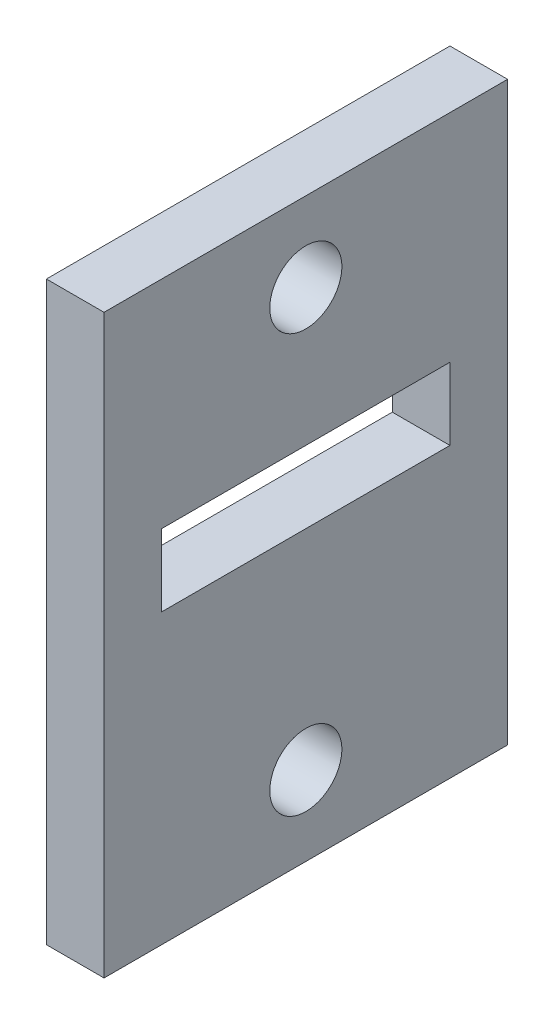
ISO-10303-21;
HEADER;
FILE_DESCRIPTION(('STEP AP214'),'2;1');
FILE_NAME('part.step','',(''),(''),'','','');
FILE_SCHEMA(('AUTOMOTIVE_DESIGN { 1 0 10303 214 1 1 1 1 }'));
ENDSEC;
DATA;
#1=APPLICATION_CONTEXT('core data for automotive mechanical design processes');
#2=APPLICATION_PROTOCOL_DEFINITION('international standard','automotive_design',2000,#1);
#3=PRODUCT_CONTEXT('',#1,'mechanical');
#4=PRODUCT('Part','Part','',(#3));
#5=PRODUCT_RELATED_PRODUCT_CATEGORY('part','',(#4));
#6=PRODUCT_DEFINITION_FORMATION('','',#4);
#7=PRODUCT_DEFINITION_CONTEXT('part definition',#1,'design');
#8=PRODUCT_DEFINITION('design','',#6,#7);
#9=PRODUCT_DEFINITION_SHAPE('','',#8);
#10=(LENGTH_UNIT() NAMED_UNIT(*) SI_UNIT(.MILLI.,.METRE.));
#11=(NAMED_UNIT(*) PLANE_ANGLE_UNIT() SI_UNIT($,.RADIAN.));
#12=(NAMED_UNIT(*) SI_UNIT($,.STERADIAN.) SOLID_ANGLE_UNIT());
#13=UNCERTAINTY_MEASURE_WITH_UNIT(LENGTH_MEASURE(1.E-05),#10,'distance_accuracy_value','');
#14=(GEOMETRIC_REPRESENTATION_CONTEXT(3) GLOBAL_UNCERTAINTY_ASSIGNED_CONTEXT((#13)) GLOBAL_UNIT_ASSIGNED_CONTEXT((#10,
#11,#12)) REPRESENTATION_CONTEXT('',''));
#15=CARTESIAN_POINT('',(0.,0.,0.));
#16=DIRECTION('',(0.,0.,1.));
#17=DIRECTION('',(1.,0.,0.));
#18=AXIS2_PLACEMENT_3D('',#15,#16,#17);
#19=CARTESIAN_POINT('',(-66.0578105075775,0.,0.));
#20=DIRECTION('',(-1.,0.,0.));
#21=DIRECTION('',(0.,0.,1.));
#22=AXIS2_PLACEMENT_3D('',#19,#20,#21);
#23=PLANE('',#22);
#24=DIRECTION('',(0.,-1.,0.));
#25=VECTOR('',#24,1.);
#26=CARTESIAN_POINT('',(-66.0578105075775,-1.10141347435617,20.));
#27=LINE('',#26,#25);
#28=CARTESIAN_POINT('',(-66.0578105075775,-1.10141347435617,20.));
#29=VERTEX_POINT('',#28);
#30=CARTESIAN_POINT('',(-66.0578105075775,-3.60141347435617,20.));
#31=VERTEX_POINT('',#30);
#32=EDGE_CURVE('E54',#29,#31,#27,.T.);
#33=ORIENTED_EDGE('',*,*,#32,.F.);
#34=DIRECTION('',(0.,0.,-1.));
#35=VECTOR('',#34,1.);
#36=CARTESIAN_POINT('',(-66.0578105075775,-1.10141347435617,20.));
#37=LINE('',#36,#35);
#38=CARTESIAN_POINT('',(-66.0578105075775,-1.10141347435617,30.));
#39=VERTEX_POINT('',#38);
#40=EDGE_CURVE('E122',#39,#29,#37,.T.);
#41=ORIENTED_EDGE('',*,*,#40,.F.);
#42=DIRECTION('',(0.,1.,0.));
#43=VECTOR('',#42,1.);
#44=CARTESIAN_POINT('',(-66.0578105075775,-1.10141347435617,30.));
#45=LINE('',#44,#43);
#46=CARTESIAN_POINT('',(-66.0578105075775,-3.60141347435617,30.));
#47=VERTEX_POINT('',#46);
#48=EDGE_CURVE('E125',#47,#39,#45,.T.);
#49=ORIENTED_EDGE('',*,*,#48,.F.);
#50=DIRECTION('',(0.,0.,1.));
#51=VECTOR('',#50,1.);
#52=CARTESIAN_POINT('',(-66.0578105075775,-3.60141347435617,20.));
#53=LINE('',#52,#51);
#54=EDGE_CURVE('E131',#31,#47,#53,.T.);
#55=ORIENTED_EDGE('',*,*,#54,.F.);
#56=EDGE_LOOP('',(#33,#41,#49,#55));
#57=FACE_BOUND('',#56,.T.);
#58=CARTESIAN_POINT('',(-66.0578105075775,-10.8514134743558,25.));
#59=DIRECTION('',(-1.,0.,0.));
#60=DIRECTION('',(0.,0.,1.));
#61=AXIS2_PLACEMENT_3D('',#58,#59,#60);
#62=CIRCLE('',#61,1.25);
#63=CARTESIAN_POINT('',(-66.0578105075775,-10.8514134743558,26.25));
#64=VERTEX_POINT('',#63);
#65=EDGE_CURVE('E147',#64,#64,#62,.T.);
#66=ORIENTED_EDGE('',*,*,#65,.F.);
#67=EDGE_LOOP('',(#66));
#68=FACE_BOUND('',#67,.T.);
#69=DIRECTION('',(0.,-1.,0.));
#70=VECTOR('',#69,1.);
#71=CARTESIAN_POINT('',(-66.0578105075775,6.39858652564383,18.));
#72=LINE('',#71,#70);
#73=CARTESIAN_POINT('',(-66.0578105075775,6.39858652564383,18.));
#74=VERTEX_POINT('',#73);
#75=CARTESIAN_POINT('',(-66.0578105075775,-13.6014134743562,18.));
#76=VERTEX_POINT('',#75);
#77=EDGE_CURVE('E153',#74,#76,#72,.T.);
#78=ORIENTED_EDGE('',*,*,#77,.T.);
#79=DIRECTION('',(0.,0.,1.));
#80=VECTOR('',#79,1.);
#81=CARTESIAN_POINT('',(-66.0578105075775,-13.6014134743562,18.));
#82=LINE('',#81,#80);
#83=CARTESIAN_POINT('',(-66.0578105075775,-13.6014134743562,32.));
#84=VERTEX_POINT('',#83);
#85=EDGE_CURVE('E156',#76,#84,#82,.T.);
#86=ORIENTED_EDGE('',*,*,#85,.T.);
#87=DIRECTION('',(0.,1.,0.));
#88=VECTOR('',#87,1.);
#89=CARTESIAN_POINT('',(-66.0578105075775,6.39858652564383,32.));
#90=LINE('',#89,#88);
#91=CARTESIAN_POINT('',(-66.0578105075775,6.39858652564383,32.));
#92=VERTEX_POINT('',#91);
#93=EDGE_CURVE('E159',#84,#92,#90,.T.);
#94=ORIENTED_EDGE('',*,*,#93,.T.);
#95=DIRECTION('',(0.,0.,-1.));
#96=VECTOR('',#95,1.);
#97=CARTESIAN_POINT('',(-66.0578105075775,6.39858652564383,18.));
#98=LINE('',#97,#96);
#99=EDGE_CURVE('E161',#92,#74,#98,.T.);
#100=ORIENTED_EDGE('',*,*,#99,.T.);
#101=EDGE_LOOP('',(#78,#86,#94,#100));
#102=FACE_BOUND('',#101,.T.);
#103=CARTESIAN_POINT('',(-66.0578105075775,3.64858652564234,25.));
#104=DIRECTION('',(-1.,0.,0.));
#105=DIRECTION('',(0.,0.,1.));
#106=AXIS2_PLACEMENT_3D('',#103,#104,#105);
#107=CIRCLE('',#106,1.25);
#108=CARTESIAN_POINT('',(-66.0578105075775,3.64858652564234,26.25));
#109=VERTEX_POINT('',#108);
#110=EDGE_CURVE('E141',#109,#109,#107,.T.);
#111=ORIENTED_EDGE('',*,*,#110,.F.);
#112=EDGE_LOOP('',(#111));
#113=FACE_BOUND('',#112,.T.);
#114=ADVANCED_FACE('F39',(#57,#68,#102,#113),#23,.T.);
#115=CARTESIAN_POINT('',(-64.0578105075775,0.,0.));
#116=DIRECTION('',(-1.,0.,0.));
#117=DIRECTION('',(0.,0.,1.));
#118=AXIS2_PLACEMENT_3D('',#115,#116,#117);
#119=PLANE('',#118);
#120=DIRECTION('',(0.,0.,-1.));
#121=VECTOR('',#120,1.);
#122=CARTESIAN_POINT('',(-64.0578105075775,-1.10141347435617,20.));
#123=LINE('',#122,#121);
#124=CARTESIAN_POINT('',(-64.0578105075775,-1.10141347435617,30.));
#125=VERTEX_POINT('',#124);
#126=CARTESIAN_POINT('',(-64.0578105075775,-1.10141347435617,20.));
#127=VERTEX_POINT('',#126);
#128=EDGE_CURVE('E112',#125,#127,#123,.T.);
#129=ORIENTED_EDGE('',*,*,#128,.T.);
#130=DIRECTION('',(0.,-1.,0.));
#131=VECTOR('',#130,1.);
#132=CARTESIAN_POINT('',(-64.0578105075775,-1.10141347435617,20.));
#133=LINE('',#132,#131);
#134=CARTESIAN_POINT('',(-64.0578105075775,-3.60141347435617,20.));
#135=VERTEX_POINT('',#134);
#136=EDGE_CURVE('E106',#127,#135,#133,.T.);
#137=ORIENTED_EDGE('',*,*,#136,.T.);
#138=DIRECTION('',(0.,0.,1.));
#139=VECTOR('',#138,1.);
#140=CARTESIAN_POINT('',(-64.0578105075775,-3.60141347435617,20.));
#141=LINE('',#140,#139);
#142=CARTESIAN_POINT('',(-64.0578105075775,-3.60141347435617,30.));
#143=VERTEX_POINT('',#142);
#144=EDGE_CURVE('E115',#135,#143,#141,.T.);
#145=ORIENTED_EDGE('',*,*,#144,.T.);
#146=DIRECTION('',(0.,1.,0.));
#147=VECTOR('',#146,1.);
#148=CARTESIAN_POINT('',(-64.0578105075775,-1.10141347435617,30.));
#149=LINE('',#148,#147);
#150=EDGE_CURVE('E62',#143,#125,#149,.T.);
#151=ORIENTED_EDGE('',*,*,#150,.T.);
#152=EDGE_LOOP('',(#129,#137,#145,#151));
#153=FACE_BOUND('',#152,.T.);
#154=DIRECTION('',(0.,-1.,0.));
#155=VECTOR('',#154,1.);
#156=CARTESIAN_POINT('',(-64.0578105075775,6.39858652564383,18.));
#157=LINE('',#156,#155);
#158=CARTESIAN_POINT('',(-64.0578105075775,6.39858652564383,18.));
#159=VERTEX_POINT('',#158);
#160=CARTESIAN_POINT('',(-64.0578105075775,-13.6014134743562,18.));
#161=VERTEX_POINT('',#160);
#162=EDGE_CURVE('E150',#159,#161,#157,.T.);
#163=ORIENTED_EDGE('',*,*,#162,.F.);
#164=DIRECTION('',(0.,0.,-1.));
#165=VECTOR('',#164,1.);
#166=CARTESIAN_POINT('',(-64.0578105075775,6.39858652564383,18.));
#167=LINE('',#166,#165);
#168=CARTESIAN_POINT('',(-64.0578105075775,6.39858652564383,32.));
#169=VERTEX_POINT('',#168);
#170=EDGE_CURVE('E157',#169,#159,#167,.T.);
#171=ORIENTED_EDGE('',*,*,#170,.F.);
#172=DIRECTION('',(0.,1.,0.));
#173=VECTOR('',#172,1.);
#174=CARTESIAN_POINT('',(-64.0578105075775,6.39858652564383,32.));
#175=LINE('',#174,#173);
#176=CARTESIAN_POINT('',(-64.0578105075775,-13.6014134743562,32.));
#177=VERTEX_POINT('',#176);
#178=EDGE_CURVE('E168',#177,#169,#175,.T.);
#179=ORIENTED_EDGE('',*,*,#178,.F.);
#180=DIRECTION('',(0.,0.,1.));
#181=VECTOR('',#180,1.);
#182=CARTESIAN_POINT('',(-64.0578105075775,-13.6014134743562,18.));
#183=LINE('',#182,#181);
#184=EDGE_CURVE('E166',#161,#177,#183,.T.);
#185=ORIENTED_EDGE('',*,*,#184,.F.);
#186=EDGE_LOOP('',(#163,#171,#179,#185));
#187=FACE_BOUND('',#186,.T.);
#188=CARTESIAN_POINT('',(-64.0578105075775,-10.8514134743558,25.));
#189=DIRECTION('',(-1.,0.,0.));
#190=DIRECTION('',(0.,0.,1.));
#191=AXIS2_PLACEMENT_3D('',#188,#189,#190);
#192=CIRCLE('',#191,1.25);
#193=CARTESIAN_POINT('',(-64.0578105075775,-10.8514134743558,26.25));
#194=VERTEX_POINT('',#193);
#195=EDGE_CURVE('E144',#194,#194,#192,.T.);
#196=ORIENTED_EDGE('',*,*,#195,.T.);
#197=EDGE_LOOP('',(#196));
#198=FACE_BOUND('',#197,.T.);
#199=CARTESIAN_POINT('',(-64.0578105075775,3.64858652564234,25.));
#200=DIRECTION('',(-1.,0.,0.));
#201=DIRECTION('',(0.,0.,1.));
#202=AXIS2_PLACEMENT_3D('',#199,#200,#201);
#203=CIRCLE('',#202,1.25);
#204=CARTESIAN_POINT('',(-64.0578105075775,3.64858652564234,26.25));
#205=VERTEX_POINT('',#204);
#206=EDGE_CURVE('E137',#205,#205,#203,.T.);
#207=ORIENTED_EDGE('',*,*,#206,.T.);
#208=EDGE_LOOP('',(#207));
#209=FACE_BOUND('',#208,.T.);
#210=ADVANCED_FACE('F119',(#153,#187,#198,#209),#119,.F.);
#211=CARTESIAN_POINT('',(-66.0578105075775,6.39858652564383,18.));
#212=DIRECTION('',(0.,0.,1.));
#213=DIRECTION('',(0.,-1.,0.));
#214=AXIS2_PLACEMENT_3D('',#211,#212,#213);
#215=PLANE('',#214);
#216=ORIENTED_EDGE('',*,*,#162,.T.);
#217=DIRECTION('',(1.,0.,0.));
#218=VECTOR('',#217,1.);
#219=CARTESIAN_POINT('',(-66.0578105075775,-13.6014134743562,18.));
#220=LINE('',#219,#218);
#221=EDGE_CURVE('E11',#76,#161,#220,.T.);
#222=ORIENTED_EDGE('',*,*,#221,.F.);
#223=ORIENTED_EDGE('',*,*,#77,.F.);
#224=DIRECTION('',(1.,0.,0.));
#225=VECTOR('',#224,1.);
#226=CARTESIAN_POINT('',(-66.0578105075775,6.39858652564383,18.));
#227=LINE('',#226,#225);
#228=EDGE_CURVE('E163',#74,#159,#227,.T.);
#229=ORIENTED_EDGE('',*,*,#228,.T.);
#230=EDGE_LOOP('',(#216,#222,#223,#229));
#231=FACE_BOUND('',#230,.T.);
#232=ADVANCED_FACE('F41',(#231),#215,.F.);
#233=CARTESIAN_POINT('',(-66.0578105075775,-13.6014134743562,18.));
#234=DIRECTION('',(0.,1.,0.));
#235=DIRECTION('',(0.,0.,1.));
#236=AXIS2_PLACEMENT_3D('',#233,#234,#235);
#237=PLANE('',#236);
#238=ORIENTED_EDGE('',*,*,#184,.T.);
#239=DIRECTION('',(1.,0.,0.));
#240=VECTOR('',#239,1.);
#241=CARTESIAN_POINT('',(-66.0578105075775,-13.6014134743562,32.));
#242=LINE('',#241,#240);
#243=EDGE_CURVE('E47',#84,#177,#242,.T.);
#244=ORIENTED_EDGE('',*,*,#243,.F.);
#245=ORIENTED_EDGE('',*,*,#85,.F.);
#246=ORIENTED_EDGE('',*,*,#221,.T.);
#247=EDGE_LOOP('',(#238,#244,#245,#246));
#248=FACE_BOUND('',#247,.T.);
#249=ADVANCED_FACE('F195',(#248),#237,.F.);
#250=CARTESIAN_POINT('',(-66.0578105075775,6.39858652564383,32.));
#251=DIRECTION('',(0.,0.,-1.));
#252=DIRECTION('',(-1.,0.,0.));
#253=AXIS2_PLACEMENT_3D('',#250,#251,#252);
#254=PLANE('',#253);
#255=ORIENTED_EDGE('',*,*,#178,.T.);
#256=DIRECTION('',(1.,0.,0.));
#257=VECTOR('',#256,1.);
#258=CARTESIAN_POINT('',(-66.0578105075775,6.39858652564383,32.));
#259=LINE('',#258,#257);
#260=EDGE_CURVE('E173',#92,#169,#259,.T.);
#261=ORIENTED_EDGE('',*,*,#260,.F.);
#262=ORIENTED_EDGE('',*,*,#93,.F.);
#263=ORIENTED_EDGE('',*,*,#243,.T.);
#264=EDGE_LOOP('',(#255,#261,#262,#263));
#265=FACE_BOUND('',#264,.T.);
#266=ADVANCED_FACE('F180',(#265),#254,.F.);
#267=CARTESIAN_POINT('',(-66.0578105075775,6.39858652564383,18.));
#268=DIRECTION('',(0.,-1.,0.));
#269=DIRECTION('',(0.,0.,-1.));
#270=AXIS2_PLACEMENT_3D('',#267,#268,#269);
#271=PLANE('',#270);
#272=ORIENTED_EDGE('',*,*,#170,.T.);
#273=ORIENTED_EDGE('',*,*,#228,.F.);
#274=ORIENTED_EDGE('',*,*,#99,.F.);
#275=ORIENTED_EDGE('',*,*,#260,.T.);
#276=EDGE_LOOP('',(#272,#273,#274,#275));
#277=FACE_BOUND('',#276,.T.);
#278=ADVANCED_FACE('F188',(#277),#271,.F.);
#279=CARTESIAN_POINT('',(-66.0578105075775,-10.8514134743558,25.));
#280=DIRECTION('',(1.,0.,0.));
#281=DIRECTION('',(0.,0.,-1.));
#282=AXIS2_PLACEMENT_3D('',#279,#280,#281);
#283=CYLINDRICAL_SURFACE('',#282,1.25);
#284=ORIENTED_EDGE('',*,*,#65,.T.);
#285=EDGE_LOOP('',(#284));
#286=FACE_BOUND('',#285,.T.);
#287=ORIENTED_EDGE('',*,*,#195,.F.);
#288=EDGE_LOOP('',(#287));
#289=FACE_BOUND('',#288,.T.);
#290=ADVANCED_FACE('F212',(#286,#289),#283,.F.);
#291=CARTESIAN_POINT('',(-66.0578105075775,3.64858652564234,25.));
#292=DIRECTION('',(1.,0.,0.));
#293=DIRECTION('',(0.,0.,-1.));
#294=AXIS2_PLACEMENT_3D('',#291,#292,#293);
#295=CYLINDRICAL_SURFACE('',#294,1.25);
#296=ORIENTED_EDGE('',*,*,#110,.T.);
#297=EDGE_LOOP('',(#296));
#298=FACE_BOUND('',#297,.T.);
#299=ORIENTED_EDGE('',*,*,#206,.F.);
#300=EDGE_LOOP('',(#299));
#301=FACE_BOUND('',#300,.T.);
#302=ADVANCED_FACE('F219',(#298,#301),#295,.F.);
#303=CARTESIAN_POINT('',(-64.0578105075775,-1.10141347435617,20.));
#304=DIRECTION('',(0.,0.,-1.));
#305=DIRECTION('',(-1.,0.,0.));
#306=AXIS2_PLACEMENT_3D('',#303,#304,#305);
#307=PLANE('',#306);
#308=ORIENTED_EDGE('',*,*,#32,.T.);
#309=DIRECTION('',(-1.,0.,0.));
#310=VECTOR('',#309,1.);
#311=CARTESIAN_POINT('',(-64.0578105075775,-3.60141347435617,20.));
#312=LINE('',#311,#310);
#313=EDGE_CURVE('E102',#135,#31,#312,.T.);
#314=ORIENTED_EDGE('',*,*,#313,.F.);
#315=ORIENTED_EDGE('',*,*,#136,.F.);
#316=DIRECTION('',(-1.,0.,0.));
#317=VECTOR('',#316,1.);
#318=CARTESIAN_POINT('',(-64.0578105075775,-1.10141347435617,20.));
#319=LINE('',#318,#317);
#320=EDGE_CURVE('E135',#127,#29,#319,.T.);
#321=ORIENTED_EDGE('',*,*,#320,.T.);
#322=EDGE_LOOP('',(#308,#314,#315,#321));
#323=FACE_BOUND('',#322,.T.);
#324=ADVANCED_FACE('F104',(#323),#307,.F.);
#325=CARTESIAN_POINT('',(-64.0578105075775,-1.10141347435617,20.));
#326=DIRECTION('',(0.,1.,0.));
#327=DIRECTION('',(0.,0.,1.));
#328=AXIS2_PLACEMENT_3D('',#325,#326,#327);
#329=PLANE('',#328);
#330=ORIENTED_EDGE('',*,*,#40,.T.);
#331=ORIENTED_EDGE('',*,*,#320,.F.);
#332=ORIENTED_EDGE('',*,*,#128,.F.);
#333=DIRECTION('',(-1.,0.,0.));
#334=VECTOR('',#333,1.);
#335=CARTESIAN_POINT('',(-64.0578105075775,-1.10141347435617,30.));
#336=LINE('',#335,#334);
#337=EDGE_CURVE('E138',#125,#39,#336,.T.);
#338=ORIENTED_EDGE('',*,*,#337,.T.);
#339=EDGE_LOOP('',(#330,#331,#332,#338));
#340=FACE_BOUND('',#339,.T.);
#341=ADVANCED_FACE('F233',(#340),#329,.F.);
#342=CARTESIAN_POINT('',(-64.0578105075775,-1.10141347435617,30.));
#343=DIRECTION('',(0.,0.,1.));
#344=DIRECTION('',(1.,0.,0.));
#345=AXIS2_PLACEMENT_3D('',#342,#343,#344);
#346=PLANE('',#345);
#347=ORIENTED_EDGE('',*,*,#48,.T.);
#348=ORIENTED_EDGE('',*,*,#337,.F.);
#349=ORIENTED_EDGE('',*,*,#150,.F.);
#350=DIRECTION('',(-1.,0.,0.));
#351=VECTOR('',#350,1.);
#352=CARTESIAN_POINT('',(-64.0578105075775,-3.60141347435617,30.));
#353=LINE('',#352,#351);
#354=EDGE_CURVE('E111',#143,#47,#353,.T.);
#355=ORIENTED_EDGE('',*,*,#354,.T.);
#356=EDGE_LOOP('',(#347,#348,#349,#355));
#357=FACE_BOUND('',#356,.T.);
#358=ADVANCED_FACE('F238',(#357),#346,.F.);
#359=CARTESIAN_POINT('',(-64.0578105075775,-3.60141347435617,20.));
#360=DIRECTION('',(0.,-1.,0.));
#361=DIRECTION('',(0.,0.,-1.));
#362=AXIS2_PLACEMENT_3D('',#359,#360,#361);
#363=PLANE('',#362);
#364=ORIENTED_EDGE('',*,*,#54,.T.);
#365=ORIENTED_EDGE('',*,*,#354,.F.);
#366=ORIENTED_EDGE('',*,*,#144,.F.);
#367=ORIENTED_EDGE('',*,*,#313,.T.);
#368=EDGE_LOOP('',(#364,#365,#366,#367));
#369=FACE_BOUND('',#368,.T.);
#370=ADVANCED_FACE('F116',(#369),#363,.F.);
#371=CLOSED_SHELL('',(#114,#210,#232,#249,#266,#278,#290,#302,#324,#341,#358,#370));
#372=MANIFOLD_SOLID_BREP('B2',#371);
#373=ADVANCED_BREP_SHAPE_REPRESENTATION('',(#18,#372),#14);
#374=SHAPE_DEFINITION_REPRESENTATION(#9,#373);
ENDSEC;
END-ISO-10303-21;
